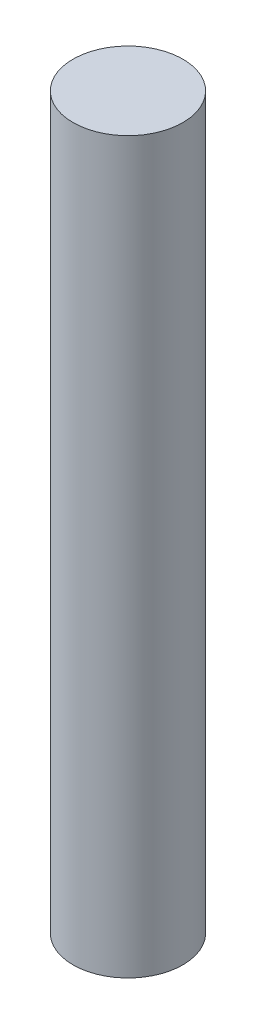
ISO-10303-21;
HEADER;
FILE_DESCRIPTION(('STEP AP214'),'2;1');
FILE_NAME('part.step','',(''),(''),'','','');
FILE_SCHEMA(('AUTOMOTIVE_DESIGN { 1 0 10303 214 1 1 1 1 }'));
ENDSEC;
DATA;
#1=APPLICATION_CONTEXT('core data for automotive mechanical design processes');
#2=APPLICATION_PROTOCOL_DEFINITION('international standard','automotive_design',2000,#1);
#3=PRODUCT_CONTEXT('',#1,'mechanical');
#4=PRODUCT('Part','Part','',(#3));
#5=PRODUCT_RELATED_PRODUCT_CATEGORY('part','',(#4));
#6=PRODUCT_DEFINITION_FORMATION('','',#4);
#7=PRODUCT_DEFINITION_CONTEXT('part definition',#1,'design');
#8=PRODUCT_DEFINITION('design','',#6,#7);
#9=PRODUCT_DEFINITION_SHAPE('','',#8);
#10=(LENGTH_UNIT() NAMED_UNIT(*) SI_UNIT(.MILLI.,.METRE.));
#11=(NAMED_UNIT(*) PLANE_ANGLE_UNIT() SI_UNIT($,.RADIAN.));
#12=(NAMED_UNIT(*) SI_UNIT($,.STERADIAN.) SOLID_ANGLE_UNIT());
#13=UNCERTAINTY_MEASURE_WITH_UNIT(LENGTH_MEASURE(1.E-05),#10,'distance_accuracy_value','');
#14=(GEOMETRIC_REPRESENTATION_CONTEXT(3) GLOBAL_UNCERTAINTY_ASSIGNED_CONTEXT((#13)) GLOBAL_UNIT_ASSIGNED_CONTEXT((#10,
#11,#12)) REPRESENTATION_CONTEXT('',''));
#15=CARTESIAN_POINT('',(0.,0.,0.));
#16=DIRECTION('',(0.,0.,1.));
#17=DIRECTION('',(1.,0.,0.));
#18=AXIS2_PLACEMENT_3D('',#15,#16,#17);
#19=CARTESIAN_POINT('',(0.,210.82,0.));
#20=DIRECTION('',(0.,-1.,0.));
#21=DIRECTION('',(0.,0.,-1.));
#22=AXIS2_PLACEMENT_3D('',#19,#20,#21);
#23=CYLINDRICAL_SURFACE('',#22,15.875);
#24=CARTESIAN_POINT('',(0.,210.82,0.));
#25=DIRECTION('',(0.,1.,0.));
#26=DIRECTION('',(0.,0.,1.));
#27=AXIS2_PLACEMENT_3D('',#24,#25,#26);
#28=CIRCLE('',#27,15.875);
#29=CARTESIAN_POINT('',(0.,210.82,15.875));
#30=VERTEX_POINT('',#29);
#31=EDGE_CURVE('E10',#30,#30,#28,.T.);
#32=ORIENTED_EDGE('',*,*,#31,.F.);
#33=EDGE_LOOP('',(#32));
#34=FACE_BOUND('',#33,.T.);
#35=CARTESIAN_POINT('',(0.,0.,0.));
#36=DIRECTION('',(0.,1.,0.));
#37=DIRECTION('',(0.,0.,1.));
#38=AXIS2_PLACEMENT_3D('',#35,#36,#37);
#39=CIRCLE('',#38,15.875);
#40=CARTESIAN_POINT('',(0.,0.,15.875));
#41=VERTEX_POINT('',#40);
#42=EDGE_CURVE('E38',#41,#41,#39,.T.);
#43=ORIENTED_EDGE('',*,*,#42,.T.);
#44=EDGE_LOOP('',(#43));
#45=FACE_BOUND('',#44,.T.);
#46=ADVANCED_FACE('F35',(#34,#45),#23,.T.);
#47=CARTESIAN_POINT('',(0.,210.82,0.));
#48=DIRECTION('',(0.,1.,0.));
#49=DIRECTION('',(0.,0.,1.));
#50=AXIS2_PLACEMENT_3D('',#47,#48,#49);
#51=PLANE('',#50);
#52=ORIENTED_EDGE('',*,*,#31,.T.);
#53=EDGE_LOOP('',(#52));
#54=FACE_BOUND('',#53,.T.);
#55=ADVANCED_FACE('F50',(#54),#51,.T.);
#56=CARTESIAN_POINT('',(0.,0.,0.));
#57=DIRECTION('',(0.,1.,0.));
#58=DIRECTION('',(0.,0.,1.));
#59=AXIS2_PLACEMENT_3D('',#56,#57,#58);
#60=PLANE('',#59);
#61=ORIENTED_EDGE('',*,*,#42,.F.);
#62=EDGE_LOOP('',(#61));
#63=FACE_BOUND('',#62,.T.);
#64=ADVANCED_FACE('F48',(#63),#60,.F.);
#65=CLOSED_SHELL('',(#46,#55,#64));
#66=MANIFOLD_SOLID_BREP('B2',#65);
#67=ADVANCED_BREP_SHAPE_REPRESENTATION('',(#18,#66),#14);
#68=SHAPE_DEFINITION_REPRESENTATION(#9,#67);
ENDSEC;
END-ISO-10303-21;
